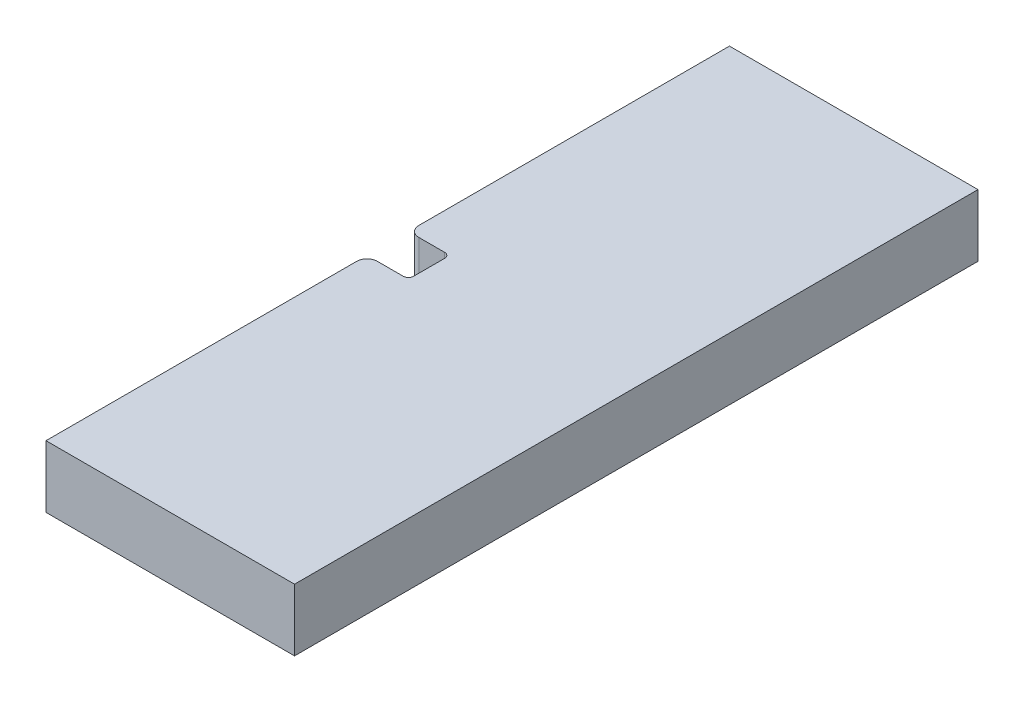
ISO-10303-21;
HEADER;
FILE_DESCRIPTION(('STEP AP214'),'2;1');
FILE_NAME('part.step','',(''),(''),'','','');
FILE_SCHEMA(('AUTOMOTIVE_DESIGN { 1 0 10303 214 1 1 1 1 }'));
ENDSEC;
DATA;
#1=APPLICATION_CONTEXT('core data for automotive mechanical design processes');
#2=APPLICATION_PROTOCOL_DEFINITION('international standard','automotive_design',2000,#1);
#3=PRODUCT_CONTEXT('',#1,'mechanical');
#4=PRODUCT('Part','Part','',(#3));
#5=PRODUCT_RELATED_PRODUCT_CATEGORY('part','',(#4));
#6=PRODUCT_DEFINITION_FORMATION('','',#4);
#7=PRODUCT_DEFINITION_CONTEXT('part definition',#1,'design');
#8=PRODUCT_DEFINITION('design','',#6,#7);
#9=PRODUCT_DEFINITION_SHAPE('','',#8);
#10=(LENGTH_UNIT() NAMED_UNIT(*) SI_UNIT(.MILLI.,.METRE.));
#11=(NAMED_UNIT(*) PLANE_ANGLE_UNIT() SI_UNIT($,.RADIAN.));
#12=(NAMED_UNIT(*) SI_UNIT($,.STERADIAN.) SOLID_ANGLE_UNIT());
#13=UNCERTAINTY_MEASURE_WITH_UNIT(LENGTH_MEASURE(1.E-05),#10,'distance_accuracy_value','');
#14=(GEOMETRIC_REPRESENTATION_CONTEXT(3) GLOBAL_UNCERTAINTY_ASSIGNED_CONTEXT((#13)) GLOBAL_UNIT_ASSIGNED_CONTEXT((#10,
#11,#12)) REPRESENTATION_CONTEXT('',''));
#15=CARTESIAN_POINT('',(0.,0.,0.));
#16=DIRECTION('',(0.,0.,1.));
#17=DIRECTION('',(1.,0.,0.));
#18=AXIS2_PLACEMENT_3D('',#15,#16,#17);
#19=CARTESIAN_POINT('',(27.965,5.17,5.625));
#20=DIRECTION('',(0.,-1.,0.));
#21=DIRECTION('',(0.,0.,-1.));
#22=AXIS2_PLACEMENT_3D('',#19,#20,#21);
#23=CYLINDRICAL_SURFACE('',#22,0.025);
#24=DIRECTION('',(0.,1.,0.));
#25=VECTOR('',#24,1.);
#26=CARTESIAN_POINT('',(27.965,5.17,5.6));
#27=LINE('',#26,#25);
#28=CARTESIAN_POINT('',(27.965,5.17,5.6));
#29=VERTEX_POINT('',#28);
#30=CARTESIAN_POINT('',(27.965,4.87,5.6));
#31=VERTEX_POINT('',#30);
#32=EDGE_CURVE('E99',#29,#31,#27,.F.);
#33=ORIENTED_EDGE('',*,*,#32,.T.);
#34=CARTESIAN_POINT('',(27.965,4.87,5.625));
#35=DIRECTION('',(0.,-1.,0.));
#36=DIRECTION('',(0.,0.,-1.));
#37=AXIS2_PLACEMENT_3D('',#34,#35,#36);
#38=CIRCLE('',#37,0.025);
#39=CARTESIAN_POINT('',(27.99,4.87,5.625));
#40=VERTEX_POINT('',#39);
#41=EDGE_CURVE('E20',#40,#31,#38,.F.);
#42=ORIENTED_EDGE('',*,*,#41,.F.);
#43=DIRECTION('',(0.,1.,0.));
#44=VECTOR('',#43,1.);
#45=CARTESIAN_POINT('',(27.99,5.17,5.625));
#46=LINE('',#45,#44);
#47=CARTESIAN_POINT('',(27.99,5.17,5.625));
#48=VERTEX_POINT('',#47);
#49=EDGE_CURVE('E104',#40,#48,#46,.T.);
#50=ORIENTED_EDGE('',*,*,#49,.T.);
#51=CARTESIAN_POINT('',(27.965,5.17,5.625));
#52=DIRECTION('',(0.,-1.,0.));
#53=DIRECTION('',(0.,0.,-1.));
#54=AXIS2_PLACEMENT_3D('',#51,#52,#53);
#55=CIRCLE('',#54,0.025);
#56=EDGE_CURVE('E100',#29,#48,#55,.T.);
#57=ORIENTED_EDGE('',*,*,#56,.F.);
#58=EDGE_LOOP('',(#33,#42,#50,#57));
#59=FACE_BOUND('',#58,.T.);
#60=ADVANCED_FACE('F17',(#59),#23,.F.);
#61=CARTESIAN_POINT('',(27.965,5.17,5.775));
#62=DIRECTION('',(0.,-1.,0.));
#63=DIRECTION('',(0.,0.,-1.));
#64=AXIS2_PLACEMENT_3D('',#61,#62,#63);
#65=CYLINDRICAL_SURFACE('',#64,0.025);
#66=DIRECTION('',(0.,1.,0.));
#67=VECTOR('',#66,1.);
#68=CARTESIAN_POINT('',(27.99,5.17,5.775));
#69=LINE('',#68,#67);
#70=CARTESIAN_POINT('',(27.99,5.17,5.775));
#71=VERTEX_POINT('',#70);
#72=CARTESIAN_POINT('',(27.99,4.87,5.775));
#73=VERTEX_POINT('',#72);
#74=EDGE_CURVE('E139',#71,#73,#69,.F.);
#75=ORIENTED_EDGE('',*,*,#74,.T.);
#76=CARTESIAN_POINT('',(27.965,4.87,5.775));
#77=DIRECTION('',(0.,-1.,0.));
#78=DIRECTION('',(0.,0.,-1.));
#79=AXIS2_PLACEMENT_3D('',#76,#77,#78);
#80=CIRCLE('',#79,0.025);
#81=CARTESIAN_POINT('',(27.965,4.87,5.8));
#82=VERTEX_POINT('',#81);
#83=EDGE_CURVE('E97',#82,#73,#80,.F.);
#84=ORIENTED_EDGE('',*,*,#83,.F.);
#85=DIRECTION('',(0.,1.,0.));
#86=VECTOR('',#85,1.);
#87=CARTESIAN_POINT('',(27.965,5.17,5.8));
#88=LINE('',#87,#86);
#89=CARTESIAN_POINT('',(27.965,5.17,5.8));
#90=VERTEX_POINT('',#89);
#91=EDGE_CURVE('E133',#82,#90,#88,.T.);
#92=ORIENTED_EDGE('',*,*,#91,.T.);
#93=CARTESIAN_POINT('',(27.965,5.17,5.775));
#94=DIRECTION('',(0.,-1.,0.));
#95=DIRECTION('',(0.,0.,-1.));
#96=AXIS2_PLACEMENT_3D('',#93,#94,#95);
#97=CIRCLE('',#96,0.025);
#98=EDGE_CURVE('E187',#71,#90,#97,.T.);
#99=ORIENTED_EDGE('',*,*,#98,.F.);
#100=EDGE_LOOP('',(#75,#84,#92,#99));
#101=FACE_BOUND('',#100,.T.);
#102=ADVANCED_FACE('F216',(#101),#65,.F.);
#103=CARTESIAN_POINT('',(28.39,5.17,5.7));
#104=DIRECTION('',(0.,1.,0.));
#105=DIRECTION('',(0.,0.,1.));
#106=AXIS2_PLACEMENT_3D('',#103,#104,#105);
#107=PLANE('',#106);
#108=ORIENTED_EDGE('',*,*,#98,.T.);
#109=DIRECTION('',(1.,0.,0.));
#110=VECTOR('',#109,1.);
#111=CARTESIAN_POINT('',(27.99,5.17,5.8));
#112=LINE('',#111,#110);
#113=CARTESIAN_POINT('',(27.84,5.17,5.8));
#114=VERTEX_POINT('',#113);
#115=EDGE_CURVE('E136',#90,#114,#112,.F.);
#116=ORIENTED_EDGE('',*,*,#115,.T.);
#117=CARTESIAN_POINT('',(27.84,5.17,5.85));
#118=DIRECTION('',(0.,-1.,0.));
#119=DIRECTION('',(0.,0.,-1.));
#120=AXIS2_PLACEMENT_3D('',#117,#118,#119);
#121=CIRCLE('',#120,0.05);
#122=CARTESIAN_POINT('',(27.79,5.17,5.85));
#123=VERTEX_POINT('',#122);
#124=EDGE_CURVE('E129',#123,#114,#121,.T.);
#125=ORIENTED_EDGE('',*,*,#124,.F.);
#126=DIRECTION('',(0.,0.,1.));
#127=VECTOR('',#126,1.);
#128=CARTESIAN_POINT('',(27.79,5.17,4.05));
#129=LINE('',#128,#127);
#130=CARTESIAN_POINT('',(27.79,5.17,7.35));
#131=VERTEX_POINT('',#130);
#132=EDGE_CURVE('E185',#131,#123,#129,.F.);
#133=ORIENTED_EDGE('',*,*,#132,.F.);
#134=DIRECTION('',(1.,0.,0.));
#135=VECTOR('',#134,1.);
#136=CARTESIAN_POINT('',(27.79,5.17,7.35));
#137=LINE('',#136,#135);
#138=CARTESIAN_POINT('',(28.99,5.17,7.35));
#139=VERTEX_POINT('',#138);
#140=EDGE_CURVE('E180',#139,#131,#137,.F.);
#141=ORIENTED_EDGE('',*,*,#140,.F.);
#142=DIRECTION('',(0.,0.,-1.));
#143=VECTOR('',#142,1.);
#144=CARTESIAN_POINT('',(28.99,5.17,7.35));
#145=LINE('',#144,#143);
#146=CARTESIAN_POINT('',(28.99,5.17,4.05));
#147=VERTEX_POINT('',#146);
#148=EDGE_CURVE('E170',#147,#139,#145,.F.);
#149=ORIENTED_EDGE('',*,*,#148,.F.);
#150=DIRECTION('',(-1.,0.,0.));
#151=VECTOR('',#150,1.);
#152=CARTESIAN_POINT('',(28.99,5.17,4.05));
#153=LINE('',#152,#151);
#154=CARTESIAN_POINT('',(27.79,5.17,4.05));
#155=VERTEX_POINT('',#154);
#156=EDGE_CURVE('E160',#155,#147,#153,.F.);
#157=ORIENTED_EDGE('',*,*,#156,.F.);
#158=DIRECTION('',(0.,0.,1.));
#159=VECTOR('',#158,1.);
#160=CARTESIAN_POINT('',(27.79,5.17,4.05));
#161=LINE('',#160,#159);
#162=CARTESIAN_POINT('',(27.79,5.17,5.55));
#163=VERTEX_POINT('',#162);
#164=EDGE_CURVE('E149',#163,#155,#161,.F.);
#165=ORIENTED_EDGE('',*,*,#164,.F.);
#166=CARTESIAN_POINT('',(27.84,5.17,5.55));
#167=DIRECTION('',(0.,1.,0.));
#168=DIRECTION('',(0.,0.,1.));
#169=AXIS2_PLACEMENT_3D('',#166,#167,#168);
#170=CIRCLE('',#169,0.05);
#171=CARTESIAN_POINT('',(27.84,5.17,5.6));
#172=VERTEX_POINT('',#171);
#173=EDGE_CURVE('E145',#172,#163,#170,.F.);
#174=ORIENTED_EDGE('',*,*,#173,.F.);
#175=DIRECTION('',(-1.,0.,0.));
#176=VECTOR('',#175,1.);
#177=CARTESIAN_POINT('',(27.79,5.17,5.6));
#178=LINE('',#177,#176);
#179=EDGE_CURVE('E105',#172,#29,#178,.F.);
#180=ORIENTED_EDGE('',*,*,#179,.T.);
#181=ORIENTED_EDGE('',*,*,#56,.T.);
#182=DIRECTION('',(0.,0.,-1.));
#183=VECTOR('',#182,1.);
#184=CARTESIAN_POINT('',(27.99,5.17,5.6));
#185=LINE('',#184,#183);
#186=EDGE_CURVE('E138',#48,#71,#185,.F.);
#187=ORIENTED_EDGE('',*,*,#186,.T.);
#188=EDGE_LOOP('',(#108,#116,#125,#133,#141,#149,#157,#165,#174,#180,#181,#187));
#189=FACE_BOUND('',#188,.T.);
#190=ADVANCED_FACE('F221',(#189),#107,.T.);
#191=CARTESIAN_POINT('',(27.79,4.87,4.05));
#192=DIRECTION('',(-1.,0.,0.));
#193=DIRECTION('',(0.,0.,1.));
#194=AXIS2_PLACEMENT_3D('',#191,#192,#193);
#195=PLANE('',#194);
#196=DIRECTION('',(0.,1.,0.));
#197=VECTOR('',#196,1.);
#198=CARTESIAN_POINT('',(27.79,4.87,7.35));
#199=LINE('',#198,#197);
#200=CARTESIAN_POINT('',(27.79,4.87,7.35));
#201=VERTEX_POINT('',#200);
#202=EDGE_CURVE('E177',#131,#201,#199,.F.);
#203=ORIENTED_EDGE('',*,*,#202,.F.);
#204=ORIENTED_EDGE('',*,*,#132,.T.);
#205=DIRECTION('',(0.,-1.,0.));
#206=VECTOR('',#205,1.);
#207=CARTESIAN_POINT('',(27.79,5.02,5.85));
#208=LINE('',#207,#206);
#209=CARTESIAN_POINT('',(27.79,4.87,5.85));
#210=VERTEX_POINT('',#209);
#211=EDGE_CURVE('E130',#210,#123,#208,.F.);
#212=ORIENTED_EDGE('',*,*,#211,.F.);
#213=DIRECTION('',(0.,0.,1.));
#214=VECTOR('',#213,1.);
#215=CARTESIAN_POINT('',(27.79,4.87,5.7));
#216=LINE('',#215,#214);
#217=EDGE_CURVE('E122',#210,#201,#216,.T.);
#218=ORIENTED_EDGE('',*,*,#217,.T.);
#219=EDGE_LOOP('',(#203,#204,#212,#218));
#220=FACE_BOUND('',#219,.T.);
#221=ADVANCED_FACE('F258',(#220),#195,.T.);
#222=CARTESIAN_POINT('',(27.79,4.87,7.35));
#223=DIRECTION('',(0.,0.,1.));
#224=DIRECTION('',(1.,0.,0.));
#225=AXIS2_PLACEMENT_3D('',#222,#223,#224);
#226=PLANE('',#225);
#227=ORIENTED_EDGE('',*,*,#140,.T.);
#228=ORIENTED_EDGE('',*,*,#202,.T.);
#229=DIRECTION('',(1.,0.,0.));
#230=VECTOR('',#229,1.);
#231=CARTESIAN_POINT('',(28.39,4.87,7.35));
#232=LINE('',#231,#230);
#233=CARTESIAN_POINT('',(28.99,4.87,7.35));
#234=VERTEX_POINT('',#233);
#235=EDGE_CURVE('E125',#201,#234,#232,.T.);
#236=ORIENTED_EDGE('',*,*,#235,.T.);
#237=DIRECTION('',(0.,1.,0.));
#238=VECTOR('',#237,1.);
#239=CARTESIAN_POINT('',(28.99,4.87,7.35));
#240=LINE('',#239,#238);
#241=EDGE_CURVE('E167',#139,#234,#240,.F.);
#242=ORIENTED_EDGE('',*,*,#241,.F.);
#243=EDGE_LOOP('',(#227,#228,#236,#242));
#244=FACE_BOUND('',#243,.T.);
#245=ADVANCED_FACE('F252',(#244),#226,.T.);
#246=CARTESIAN_POINT('',(28.99,4.87,7.35));
#247=DIRECTION('',(1.,0.,0.));
#248=DIRECTION('',(0.,0.,-1.));
#249=AXIS2_PLACEMENT_3D('',#246,#247,#248);
#250=PLANE('',#249);
#251=ORIENTED_EDGE('',*,*,#148,.T.);
#252=ORIENTED_EDGE('',*,*,#241,.T.);
#253=DIRECTION('',(0.,0.,1.));
#254=VECTOR('',#253,1.);
#255=CARTESIAN_POINT('',(28.99,4.87,5.7));
#256=LINE('',#255,#254);
#257=CARTESIAN_POINT('',(28.99,4.87,4.05));
#258=VERTEX_POINT('',#257);
#259=EDGE_CURVE('E154',#234,#258,#256,.F.);
#260=ORIENTED_EDGE('',*,*,#259,.T.);
#261=DIRECTION('',(0.,1.,0.));
#262=VECTOR('',#261,1.);
#263=CARTESIAN_POINT('',(28.99,4.87,4.05));
#264=LINE('',#263,#262);
#265=EDGE_CURVE('E157',#147,#258,#264,.F.);
#266=ORIENTED_EDGE('',*,*,#265,.F.);
#267=EDGE_LOOP('',(#251,#252,#260,#266));
#268=FACE_BOUND('',#267,.T.);
#269=ADVANCED_FACE('F260',(#268),#250,.T.);
#270=CARTESIAN_POINT('',(28.99,4.87,4.05));
#271=DIRECTION('',(0.,0.,-1.));
#272=DIRECTION('',(-1.,0.,0.));
#273=AXIS2_PLACEMENT_3D('',#270,#271,#272);
#274=PLANE('',#273);
#275=ORIENTED_EDGE('',*,*,#156,.T.);
#276=ORIENTED_EDGE('',*,*,#265,.T.);
#277=DIRECTION('',(1.,0.,0.));
#278=VECTOR('',#277,1.);
#279=CARTESIAN_POINT('',(28.39,4.87,4.05));
#280=LINE('',#279,#278);
#281=CARTESIAN_POINT('',(27.79,4.87,4.05));
#282=VERTEX_POINT('',#281);
#283=EDGE_CURVE('E119',#258,#282,#280,.F.);
#284=ORIENTED_EDGE('',*,*,#283,.T.);
#285=DIRECTION('',(0.,1.,0.));
#286=VECTOR('',#285,1.);
#287=CARTESIAN_POINT('',(27.79,4.87,4.05));
#288=LINE('',#287,#286);
#289=EDGE_CURVE('E146',#155,#282,#288,.F.);
#290=ORIENTED_EDGE('',*,*,#289,.F.);
#291=EDGE_LOOP('',(#275,#276,#284,#290));
#292=FACE_BOUND('',#291,.T.);
#293=ADVANCED_FACE('F236',(#292),#274,.T.);
#294=CARTESIAN_POINT('',(27.79,4.87,4.05));
#295=DIRECTION('',(-1.,0.,0.));
#296=DIRECTION('',(0.,0.,1.));
#297=AXIS2_PLACEMENT_3D('',#294,#295,#296);
#298=PLANE('',#297);
#299=ORIENTED_EDGE('',*,*,#289,.T.);
#300=DIRECTION('',(0.,0.,1.));
#301=VECTOR('',#300,1.);
#302=CARTESIAN_POINT('',(27.79,4.87,5.7));
#303=LINE('',#302,#301);
#304=CARTESIAN_POINT('',(27.79,4.87,5.55));
#305=VERTEX_POINT('',#304);
#306=EDGE_CURVE('E113',#282,#305,#303,.T.);
#307=ORIENTED_EDGE('',*,*,#306,.T.);
#308=DIRECTION('',(0.,1.,0.));
#309=VECTOR('',#308,1.);
#310=CARTESIAN_POINT('',(27.79,5.02,5.55));
#311=LINE('',#310,#309);
#312=EDGE_CURVE('E142',#163,#305,#311,.F.);
#313=ORIENTED_EDGE('',*,*,#312,.F.);
#314=ORIENTED_EDGE('',*,*,#164,.T.);
#315=EDGE_LOOP('',(#299,#307,#313,#314));
#316=FACE_BOUND('',#315,.T.);
#317=ADVANCED_FACE('F230',(#316),#298,.T.);
#318=CARTESIAN_POINT('',(27.84,5.02,5.55));
#319=DIRECTION('',(0.,1.,0.));
#320=DIRECTION('',(0.,0.,1.));
#321=AXIS2_PLACEMENT_3D('',#318,#319,#320);
#322=CYLINDRICAL_SURFACE('',#321,0.05);
#323=CARTESIAN_POINT('',(27.84,4.87,5.55));
#324=DIRECTION('',(0.,1.,0.));
#325=DIRECTION('',(0.,0.,1.));
#326=AXIS2_PLACEMENT_3D('',#323,#324,#325);
#327=CIRCLE('',#326,0.05);
#328=CARTESIAN_POINT('',(27.84,4.87,5.6));
#329=VERTEX_POINT('',#328);
#330=EDGE_CURVE('E110',#305,#329,#327,.T.);
#331=ORIENTED_EDGE('',*,*,#330,.T.);
#332=DIRECTION('',(0.,1.,0.));
#333=VECTOR('',#332,1.);
#334=CARTESIAN_POINT('',(27.84,5.17,5.6));
#335=LINE('',#334,#333);
#336=EDGE_CURVE('E109',#329,#172,#335,.T.);
#337=ORIENTED_EDGE('',*,*,#336,.T.);
#338=ORIENTED_EDGE('',*,*,#173,.T.);
#339=ORIENTED_EDGE('',*,*,#312,.T.);
#340=EDGE_LOOP('',(#331,#337,#338,#339));
#341=FACE_BOUND('',#340,.T.);
#342=ADVANCED_FACE('F225',(#341),#322,.T.);
#343=CARTESIAN_POINT('',(27.79,5.17,5.6));
#344=DIRECTION('',(0.,0.,-1.));
#345=DIRECTION('',(-1.,0.,0.));
#346=AXIS2_PLACEMENT_3D('',#343,#344,#345);
#347=PLANE('',#346);
#348=ORIENTED_EDGE('',*,*,#179,.F.);
#349=ORIENTED_EDGE('',*,*,#336,.F.);
#350=DIRECTION('',(1.,0.,0.));
#351=VECTOR('',#350,1.);
#352=CARTESIAN_POINT('',(28.39,4.87,5.6));
#353=LINE('',#352,#351);
#354=EDGE_CURVE('E93',#329,#31,#353,.T.);
#355=ORIENTED_EDGE('',*,*,#354,.T.);
#356=ORIENTED_EDGE('',*,*,#32,.F.);
#357=EDGE_LOOP('',(#348,#349,#355,#356));
#358=FACE_BOUND('',#357,.T.);
#359=ADVANCED_FACE('F107',(#358),#347,.F.);
#360=CARTESIAN_POINT('',(27.99,5.17,5.6));
#361=DIRECTION('',(1.,0.,0.));
#362=DIRECTION('',(0.,0.,-1.));
#363=AXIS2_PLACEMENT_3D('',#360,#361,#362);
#364=PLANE('',#363);
#365=ORIENTED_EDGE('',*,*,#186,.F.);
#366=ORIENTED_EDGE('',*,*,#49,.F.);
#367=DIRECTION('',(0.,0.,1.));
#368=VECTOR('',#367,1.);
#369=CARTESIAN_POINT('',(27.99,4.87,5.7));
#370=LINE('',#369,#368);
#371=EDGE_CURVE('E96',#40,#73,#370,.T.);
#372=ORIENTED_EDGE('',*,*,#371,.T.);
#373=ORIENTED_EDGE('',*,*,#74,.F.);
#374=EDGE_LOOP('',(#365,#366,#372,#373));
#375=FACE_BOUND('',#374,.T.);
#376=ADVANCED_FACE('F219',(#375),#364,.F.);
#377=CARTESIAN_POINT('',(27.99,5.17,5.8));
#378=DIRECTION('',(0.,0.,1.));
#379=DIRECTION('',(1.,0.,0.));
#380=AXIS2_PLACEMENT_3D('',#377,#378,#379);
#381=PLANE('',#380);
#382=DIRECTION('',(1.,0.,0.));
#383=VECTOR('',#382,1.);
#384=CARTESIAN_POINT('',(28.39,4.87,5.8));
#385=LINE('',#384,#383);
#386=CARTESIAN_POINT('',(27.84,4.87,5.8));
#387=VERTEX_POINT('',#386);
#388=EDGE_CURVE('E26',#82,#387,#385,.F.);
#389=ORIENTED_EDGE('',*,*,#388,.T.);
#390=DIRECTION('',(0.,-1.,0.));
#391=VECTOR('',#390,1.);
#392=CARTESIAN_POINT('',(27.84,5.02,5.8));
#393=LINE('',#392,#391);
#394=EDGE_CURVE('E34',#114,#387,#393,.T.);
#395=ORIENTED_EDGE('',*,*,#394,.F.);
#396=ORIENTED_EDGE('',*,*,#115,.F.);
#397=ORIENTED_EDGE('',*,*,#91,.F.);
#398=EDGE_LOOP('',(#389,#395,#396,#397));
#399=FACE_BOUND('',#398,.T.);
#400=ADVANCED_FACE('F276',(#399),#381,.F.);
#401=CARTESIAN_POINT('',(27.84,5.02,5.85));
#402=DIRECTION('',(0.,-1.,0.));
#403=DIRECTION('',(0.,0.,-1.));
#404=AXIS2_PLACEMENT_3D('',#401,#402,#403);
#405=CYLINDRICAL_SURFACE('',#404,0.05);
#406=ORIENTED_EDGE('',*,*,#124,.T.);
#407=ORIENTED_EDGE('',*,*,#394,.T.);
#408=CARTESIAN_POINT('',(27.84,4.87,5.85));
#409=DIRECTION('',(0.,-1.,0.));
#410=DIRECTION('',(0.,0.,-1.));
#411=AXIS2_PLACEMENT_3D('',#408,#409,#410);
#412=CIRCLE('',#411,0.05);
#413=EDGE_CURVE('E11',#387,#210,#412,.F.);
#414=ORIENTED_EDGE('',*,*,#413,.T.);
#415=ORIENTED_EDGE('',*,*,#211,.T.);
#416=EDGE_LOOP('',(#406,#407,#414,#415));
#417=FACE_BOUND('',#416,.T.);
#418=ADVANCED_FACE('F271',(#417),#405,.T.);
#419=CARTESIAN_POINT('',(28.39,4.87,5.7));
#420=DIRECTION('',(0.,1.,0.));
#421=DIRECTION('',(0.,0.,1.));
#422=AXIS2_PLACEMENT_3D('',#419,#420,#421);
#423=PLANE('',#422);
#424=ORIENTED_EDGE('',*,*,#388,.F.);
#425=ORIENTED_EDGE('',*,*,#83,.T.);
#426=ORIENTED_EDGE('',*,*,#371,.F.);
#427=ORIENTED_EDGE('',*,*,#41,.T.);
#428=ORIENTED_EDGE('',*,*,#354,.F.);
#429=ORIENTED_EDGE('',*,*,#330,.F.);
#430=ORIENTED_EDGE('',*,*,#306,.F.);
#431=ORIENTED_EDGE('',*,*,#283,.F.);
#432=ORIENTED_EDGE('',*,*,#259,.F.);
#433=ORIENTED_EDGE('',*,*,#235,.F.);
#434=ORIENTED_EDGE('',*,*,#217,.F.);
#435=ORIENTED_EDGE('',*,*,#413,.F.);
#436=EDGE_LOOP('',(#424,#425,#426,#427,#428,#429,#430,#431,#432,#433,#434,#435));
#437=FACE_BOUND('',#436,.T.);
#438=ADVANCED_FACE('F90',(#437),#423,.F.);
#439=CLOSED_SHELL('',(#60,#102,#190,#221,#245,#269,#293,#317,#342,#359,#376,#400,#418,#438));
#440=MANIFOLD_SOLID_BREP('B1',#439);
#441=ADVANCED_BREP_SHAPE_REPRESENTATION('',(#18,#440),#14);
#442=SHAPE_DEFINITION_REPRESENTATION(#9,#441);
ENDSEC;
END-ISO-10303-21;
